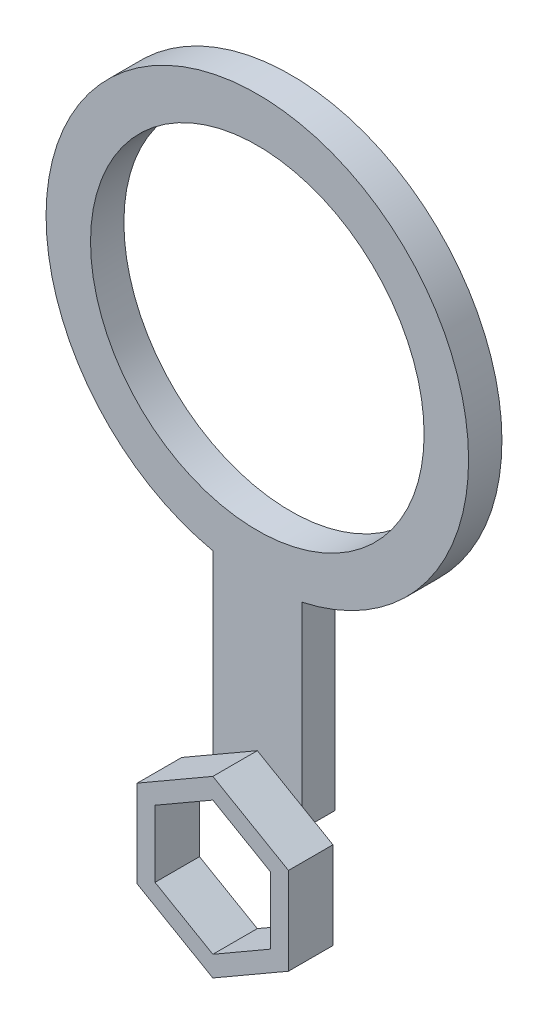
ISO-10303-21;
HEADER;
FILE_DESCRIPTION(('STEP AP214'),'2;1');
FILE_NAME('part.step','',(''),(''),'','','');
FILE_SCHEMA(('AUTOMOTIVE_DESIGN { 1 0 10303 214 1 1 1 1 }'));
ENDSEC;
DATA;
#1=APPLICATION_CONTEXT('core data for automotive mechanical design processes');
#2=APPLICATION_PROTOCOL_DEFINITION('international standard','automotive_design',2000,#1);
#3=PRODUCT_CONTEXT('',#1,'mechanical');
#4=PRODUCT('Part','Part','',(#3));
#5=PRODUCT_RELATED_PRODUCT_CATEGORY('part','',(#4));
#6=PRODUCT_DEFINITION_FORMATION('','',#4);
#7=PRODUCT_DEFINITION_CONTEXT('part definition',#1,'design');
#8=PRODUCT_DEFINITION('design','',#6,#7);
#9=PRODUCT_DEFINITION_SHAPE('','',#8);
#10=(LENGTH_UNIT() NAMED_UNIT(*) SI_UNIT(.MILLI.,.METRE.));
#11=(NAMED_UNIT(*) PLANE_ANGLE_UNIT() SI_UNIT($,.RADIAN.));
#12=(NAMED_UNIT(*) SI_UNIT($,.STERADIAN.) SOLID_ANGLE_UNIT());
#13=UNCERTAINTY_MEASURE_WITH_UNIT(LENGTH_MEASURE(1.E-05),#10,'distance_accuracy_value','');
#14=(GEOMETRIC_REPRESENTATION_CONTEXT(3) GLOBAL_UNCERTAINTY_ASSIGNED_CONTEXT((#13)) GLOBAL_UNIT_ASSIGNED_CONTEXT((#10,
#11,#12)) REPRESENTATION_CONTEXT('',''));
#15=CARTESIAN_POINT('',(0.,0.,0.));
#16=DIRECTION('',(0.,0.,1.));
#17=DIRECTION('',(1.,0.,0.));
#18=AXIS2_PLACEMENT_3D('',#15,#16,#17);
#19=CARTESIAN_POINT('',(4.,0.,3.));
#20=DIRECTION('',(-1.,0.,0.));
#21=DIRECTION('',(0.,-1.,0.));
#22=AXIS2_PLACEMENT_3D('',#19,#20,#21);
#23=PLANE('',#22);
#24=DIRECTION('',(0.,1.,0.));
#25=VECTOR('',#24,1.);
#26=CARTESIAN_POINT('',(4.,0.,3.));
#27=LINE('',#26,#25);
#28=CARTESIAN_POINT('',(4.,3.69504172281361,3.));
#29=VERTEX_POINT('',#28);
#30=CARTESIAN_POINT('',(4.,5.54256258422041,3.));
#31=VERTEX_POINT('',#30);
#32=EDGE_CURVE('E81',#29,#31,#27,.T.);
#33=ORIENTED_EDGE('',*,*,#32,.F.);
#34=DIRECTION('',(0.,0.,1.));
#35=VECTOR('',#34,1.);
#36=CARTESIAN_POINT('',(4.,3.69504172281361,0.));
#37=LINE('',#36,#35);
#38=CARTESIAN_POINT('',(4.,3.69504172281361,0.));
#39=VERTEX_POINT('',#38);
#40=EDGE_CURVE('E173',#39,#29,#37,.T.);
#41=ORIENTED_EDGE('',*,*,#40,.F.);
#42=DIRECTION('',(0.,1.,0.));
#43=VECTOR('',#42,1.);
#44=CARTESIAN_POINT('',(4.,0.,0.));
#45=LINE('',#44,#43);
#46=CARTESIAN_POINT('',(4.,21.4258243789933,0.));
#47=VERTEX_POINT('',#46);
#48=EDGE_CURVE('E72',#39,#47,#45,.T.);
#49=ORIENTED_EDGE('',*,*,#48,.T.);
#50=DIRECTION('',(0.,0.,-1.));
#51=VECTOR('',#50,1.);
#52=CARTESIAN_POINT('',(4.,21.4258243789933,3.));
#53=LINE('',#52,#51);
#54=CARTESIAN_POINT('',(4.,21.4258243789933,3.));
#55=VERTEX_POINT('',#54);
#56=EDGE_CURVE('E44',#55,#47,#53,.T.);
#57=ORIENTED_EDGE('',*,*,#56,.F.);
#58=EDGE_CURVE('E210',#31,#55,#27,.T.);
#59=ORIENTED_EDGE('',*,*,#58,.F.);
#60=EDGE_LOOP('',(#33,#41,#49,#57,#59));
#61=FACE_BOUND('',#60,.T.);
#62=ADVANCED_FACE('F41',(#61),#23,.F.);
#63=CARTESIAN_POINT('',(0.,40.,3.));
#64=DIRECTION('',(0.,0.,-1.));
#65=DIRECTION('',(-1.,0.,0.));
#66=AXIS2_PLACEMENT_3D('',#63,#64,#65);
#67=CYLINDRICAL_SURFACE('',#66,19.);
#68=CARTESIAN_POINT('',(0.,40.,0.));
#69=DIRECTION('',(0.,0.,1.));
#70=DIRECTION('',(1.,0.,0.));
#71=AXIS2_PLACEMENT_3D('',#68,#69,#70);
#72=CIRCLE('',#71,19.);
#73=CARTESIAN_POINT('',(-4.,21.4258243789933,0.));
#74=VERTEX_POINT('',#73);
#75=EDGE_CURVE('E190',#47,#74,#72,.T.);
#76=ORIENTED_EDGE('',*,*,#75,.T.);
#77=DIRECTION('',(0.,0.,-1.));
#78=VECTOR('',#77,1.);
#79=CARTESIAN_POINT('',(-4.,21.4258243789933,3.));
#80=LINE('',#79,#78);
#81=CARTESIAN_POINT('',(-4.,21.4258243789933,3.));
#82=VERTEX_POINT('',#81);
#83=EDGE_CURVE('E211',#82,#74,#80,.T.);
#84=ORIENTED_EDGE('',*,*,#83,.F.);
#85=CARTESIAN_POINT('',(0.,40.,3.));
#86=DIRECTION('',(0.,0.,1.));
#87=DIRECTION('',(1.,0.,0.));
#88=AXIS2_PLACEMENT_3D('',#85,#86,#87);
#89=CIRCLE('',#88,19.);
#90=EDGE_CURVE('E224',#55,#82,#89,.T.);
#91=ORIENTED_EDGE('',*,*,#90,.F.);
#92=ORIENTED_EDGE('',*,*,#56,.T.);
#93=EDGE_LOOP('',(#76,#84,#91,#92));
#94=FACE_BOUND('',#93,.T.);
#95=ADVANCED_FACE('F372',(#94),#67,.T.);
#96=CARTESIAN_POINT('',(-4.,0.,3.));
#97=DIRECTION('',(-1.,0.,0.));
#98=DIRECTION('',(0.,0.,1.));
#99=AXIS2_PLACEMENT_3D('',#96,#97,#98);
#100=PLANE('',#99);
#101=DIRECTION('',(0.,0.,1.));
#102=VECTOR('',#101,1.);
#103=CARTESIAN_POINT('',(-4.,3.69504172281361,0.));
#104=LINE('',#103,#102);
#105=CARTESIAN_POINT('',(-4.,3.69504172281361,0.));
#106=VERTEX_POINT('',#105);
#107=CARTESIAN_POINT('',(-4.,3.69504172281361,3.));
#108=VERTEX_POINT('',#107);
#109=EDGE_CURVE('E184',#106,#108,#104,.T.);
#110=ORIENTED_EDGE('',*,*,#109,.T.);
#111=DIRECTION('',(0.,1.,0.));
#112=VECTOR('',#111,1.);
#113=CARTESIAN_POINT('',(-4.,0.,3.));
#114=LINE('',#113,#112);
#115=CARTESIAN_POINT('',(-4.,5.54256258422041,3.));
#116=VERTEX_POINT('',#115);
#117=EDGE_CURVE('E218',#108,#116,#114,.T.);
#118=ORIENTED_EDGE('',*,*,#117,.T.);
#119=EDGE_CURVE('E60',#116,#82,#114,.T.);
#120=ORIENTED_EDGE('',*,*,#119,.T.);
#121=ORIENTED_EDGE('',*,*,#83,.T.);
#122=DIRECTION('',(0.,1.,0.));
#123=VECTOR('',#122,1.);
#124=CARTESIAN_POINT('',(-4.,0.,0.));
#125=LINE('',#124,#123);
#126=EDGE_CURVE('E196',#106,#74,#125,.T.);
#127=ORIENTED_EDGE('',*,*,#126,.F.);
#128=EDGE_LOOP('',(#110,#118,#120,#121,#127));
#129=FACE_BOUND('',#128,.T.);
#130=ADVANCED_FACE('F352',(#129),#100,.T.);
#131=CARTESIAN_POINT('',(0.,40.,3.));
#132=DIRECTION('',(0.,0.,-1.));
#133=DIRECTION('',(-1.,0.,0.));
#134=AXIS2_PLACEMENT_3D('',#131,#132,#133);
#135=CYLINDRICAL_SURFACE('',#134,15.);
#136=CARTESIAN_POINT('',(0.,40.,3.));
#137=DIRECTION('',(0.,0.,1.));
#138=DIRECTION('',(1.,0.,0.));
#139=AXIS2_PLACEMENT_3D('',#136,#137,#138);
#140=CIRCLE('',#139,15.);
#141=CARTESIAN_POINT('',(15.,40.,3.));
#142=VERTEX_POINT('',#141);
#143=EDGE_CURVE('E202',#142,#142,#140,.T.);
#144=ORIENTED_EDGE('',*,*,#143,.T.);
#145=EDGE_LOOP('',(#144));
#146=FACE_BOUND('',#145,.T.);
#147=CARTESIAN_POINT('',(0.,40.,0.));
#148=DIRECTION('',(0.,0.,1.));
#149=DIRECTION('',(1.,0.,0.));
#150=AXIS2_PLACEMENT_3D('',#147,#148,#149);
#151=CIRCLE('',#150,15.);
#152=CARTESIAN_POINT('',(15.,40.,0.));
#153=VERTEX_POINT('',#152);
#154=EDGE_CURVE('E207',#153,#153,#151,.T.);
#155=ORIENTED_EDGE('',*,*,#154,.F.);
#156=EDGE_LOOP('',(#155));
#157=FACE_BOUND('',#156,.T.);
#158=ADVANCED_FACE('F379',(#146,#157),#135,.F.);
#159=CARTESIAN_POINT('',(0.,0.,3.));
#160=DIRECTION('',(0.,0.,1.));
#161=DIRECTION('',(1.,0.,0.));
#162=AXIS2_PLACEMENT_3D('',#159,#160,#161);
#163=PLANE('',#162);
#164=DIRECTION('',(-0.866025403784438,-0.500000000000001,0.));
#165=VECTOR('',#164,1.);
#166=CARTESIAN_POINT('',(0.,7.85196366097892,3.));
#167=LINE('',#166,#165);
#168=CARTESIAN_POINT('',(0.,7.85196366097892,3.));
#169=VERTEX_POINT('',#168);
#170=EDGE_CURVE('E254',#169,#116,#167,.T.);
#171=ORIENTED_EDGE('',*,*,#170,.F.);
#172=DIRECTION('',(-0.866025403784439,0.5,0.));
#173=VECTOR('',#172,1.);
#174=CARTESIAN_POINT('',(6.80000000000001,3.92598183048946,3.));
#175=LINE('',#174,#173);
#176=EDGE_CURVE('E11',#31,#169,#175,.T.);
#177=ORIENTED_EDGE('',*,*,#176,.F.);
#178=ORIENTED_EDGE('',*,*,#58,.T.);
#179=ORIENTED_EDGE('',*,*,#90,.T.);
#180=ORIENTED_EDGE('',*,*,#119,.F.);
#181=EDGE_LOOP('',(#171,#177,#178,#179,#180));
#182=FACE_BOUND('',#181,.T.);
#183=ORIENTED_EDGE('',*,*,#143,.F.);
#184=EDGE_LOOP('',(#183));
#185=FACE_BOUND('',#184,.T.);
#186=ADVANCED_FACE('F368',(#182,#185),#163,.T.);
#187=CARTESIAN_POINT('',(0.,0.,0.));
#188=DIRECTION('',(0.,0.,1.));
#189=DIRECTION('',(1.,0.,0.));
#190=AXIS2_PLACEMENT_3D('',#187,#188,#189);
#191=PLANE('',#190);
#192=DIRECTION('',(-0.866025403784439,0.5,0.));
#193=VECTOR('',#192,1.);
#194=CARTESIAN_POINT('',(4.,3.69504172281361,0.));
#195=LINE('',#194,#193);
#196=CARTESIAN_POINT('',(0.,6.00444279957211,0.));
#197=VERTEX_POINT('',#196);
#198=EDGE_CURVE('E170',#39,#197,#195,.T.);
#199=ORIENTED_EDGE('',*,*,#198,.T.);
#200=DIRECTION('',(-0.866025403784438,-0.5,0.));
#201=VECTOR('',#200,1.);
#202=CARTESIAN_POINT('',(0.,6.00444279957211,0.));
#203=LINE('',#202,#201);
#204=EDGE_CURVE('E180',#197,#106,#203,.T.);
#205=ORIENTED_EDGE('',*,*,#204,.T.);
#206=ORIENTED_EDGE('',*,*,#126,.T.);
#207=ORIENTED_EDGE('',*,*,#75,.F.);
#208=ORIENTED_EDGE('',*,*,#48,.F.);
#209=EDGE_LOOP('',(#199,#205,#206,#207,#208));
#210=FACE_BOUND('',#209,.T.);
#211=ORIENTED_EDGE('',*,*,#154,.T.);
#212=EDGE_LOOP('',(#211));
#213=FACE_BOUND('',#212,.T.);
#214=ADVANCED_FACE('F187',(#210,#213),#191,.F.);
#215=CARTESIAN_POINT('',(0.,0.,3.));
#216=DIRECTION('',(0.,0.,1.));
#217=DIRECTION('',(1.,0.,0.));
#218=AXIS2_PLACEMENT_3D('',#215,#216,#217);
#219=PLANE('',#218);
#220=DIRECTION('',(-0.866025403784439,0.5,0.));
#221=VECTOR('',#220,1.);
#222=CARTESIAN_POINT('',(5.2,3.00222139978606,3.));
#223=LINE('',#222,#221);
#224=CARTESIAN_POINT('',(5.2,3.00222139978606,3.));
#225=VERTEX_POINT('',#224);
#226=EDGE_CURVE('E316',#225,#29,#223,.T.);
#227=ORIENTED_EDGE('',*,*,#226,.T.);
#228=ORIENTED_EDGE('',*,*,#32,.T.);
#229=CARTESIAN_POINT('',(6.80000000000001,3.92598183048946,3.));
#230=VERTEX_POINT('',#229);
#231=EDGE_CURVE('E52',#230,#31,#175,.T.);
#232=ORIENTED_EDGE('',*,*,#231,.F.);
#233=DIRECTION('',(0.,1.,0.));
#234=VECTOR('',#233,1.);
#235=CARTESIAN_POINT('',(6.8,-3.92598183048946,3.));
#236=LINE('',#235,#234);
#237=CARTESIAN_POINT('',(6.8,-3.92598183048946,3.));
#238=VERTEX_POINT('',#237);
#239=EDGE_CURVE('E260',#238,#230,#236,.T.);
#240=ORIENTED_EDGE('',*,*,#239,.F.);
#241=DIRECTION('',(0.866025403784438,0.5,0.));
#242=VECTOR('',#241,1.);
#243=CARTESIAN_POINT('',(0.,-7.85196366097892,3.));
#244=LINE('',#243,#242);
#245=CARTESIAN_POINT('',(0.,-7.85196366097892,3.));
#246=VERTEX_POINT('',#245);
#247=EDGE_CURVE('E263',#246,#238,#244,.T.);
#248=ORIENTED_EDGE('',*,*,#247,.F.);
#249=DIRECTION('',(0.866025403784439,-0.5,0.));
#250=VECTOR('',#249,1.);
#251=CARTESIAN_POINT('',(-6.80000000000001,-3.92598183048946,3.));
#252=LINE('',#251,#250);
#253=CARTESIAN_POINT('',(-6.80000000000001,-3.92598183048946,3.));
#254=VERTEX_POINT('',#253);
#255=EDGE_CURVE('E266',#254,#246,#252,.T.);
#256=ORIENTED_EDGE('',*,*,#255,.F.);
#257=DIRECTION('',(0.,-1.,0.));
#258=VECTOR('',#257,1.);
#259=CARTESIAN_POINT('',(-6.80000000000001,3.92598183048946,3.));
#260=LINE('',#259,#258);
#261=CARTESIAN_POINT('',(-6.80000000000001,3.92598183048946,3.));
#262=VERTEX_POINT('',#261);
#263=EDGE_CURVE('E250',#262,#254,#260,.T.);
#264=ORIENTED_EDGE('',*,*,#263,.F.);
#265=EDGE_CURVE('E257',#116,#262,#167,.T.);
#266=ORIENTED_EDGE('',*,*,#265,.F.);
#267=ORIENTED_EDGE('',*,*,#117,.F.);
#268=DIRECTION('',(-0.866025403784439,-0.5,0.));
#269=VECTOR('',#268,1.);
#270=CARTESIAN_POINT('',(0.,6.00444279957211,3.));
#271=LINE('',#270,#269);
#272=CARTESIAN_POINT('',(-5.2,3.00222139978606,3.));
#273=VERTEX_POINT('',#272);
#274=EDGE_CURVE('E313',#108,#273,#271,.T.);
#275=ORIENTED_EDGE('',*,*,#274,.T.);
#276=DIRECTION('',(0.,-1.,0.));
#277=VECTOR('',#276,1.);
#278=CARTESIAN_POINT('',(-5.2,3.00222139978606,3.));
#279=LINE('',#278,#277);
#280=CARTESIAN_POINT('',(-5.2,-3.00222139978606,3.));
#281=VERTEX_POINT('',#280);
#282=EDGE_CURVE('E308',#273,#281,#279,.T.);
#283=ORIENTED_EDGE('',*,*,#282,.T.);
#284=DIRECTION('',(0.866025403784439,-0.5,0.));
#285=VECTOR('',#284,1.);
#286=CARTESIAN_POINT('',(-5.2,-3.00222139978606,3.));
#287=LINE('',#286,#285);
#288=CARTESIAN_POINT('',(0.,-6.00444279957211,3.));
#289=VERTEX_POINT('',#288);
#290=EDGE_CURVE('E327',#281,#289,#287,.T.);
#291=ORIENTED_EDGE('',*,*,#290,.T.);
#292=DIRECTION('',(0.866025403784438,0.5,0.));
#293=VECTOR('',#292,1.);
#294=CARTESIAN_POINT('',(0.,-6.00444279957211,3.));
#295=LINE('',#294,#293);
#296=CARTESIAN_POINT('',(5.2,-3.00222139978606,3.));
#297=VERTEX_POINT('',#296);
#298=EDGE_CURVE('E323',#289,#297,#295,.T.);
#299=ORIENTED_EDGE('',*,*,#298,.T.);
#300=DIRECTION('',(0.,1.,0.));
#301=VECTOR('',#300,1.);
#302=CARTESIAN_POINT('',(5.2,-3.00222139978606,3.));
#303=LINE('',#302,#301);
#304=EDGE_CURVE('E319',#297,#225,#303,.T.);
#305=ORIENTED_EDGE('',*,*,#304,.T.);
#306=EDGE_LOOP('',(#227,#228,#232,#240,#248,#256,#264,#266,#267,#275,#283,#291,#299,#305));
#307=FACE_BOUND('',#306,.T.);
#308=ADVANCED_FACE('F356',(#307),#219,.F.);
#309=CARTESIAN_POINT('',(0.,0.,7.));
#310=DIRECTION('',(0.,0.,1.));
#311=DIRECTION('',(1.,0.,0.));
#312=AXIS2_PLACEMENT_3D('',#309,#310,#311);
#313=PLANE('',#312);
#314=DIRECTION('',(0.866025403784439,-0.5,0.));
#315=VECTOR('',#314,1.);
#316=CARTESIAN_POINT('',(-6.80000000000001,-3.92598183048946,7.));
#317=LINE('',#316,#315);
#318=CARTESIAN_POINT('',(-6.80000000000001,-3.92598183048946,7.));
#319=VERTEX_POINT('',#318);
#320=CARTESIAN_POINT('',(0.,-7.85196366097892,7.));
#321=VERTEX_POINT('',#320);
#322=EDGE_CURVE('E253',#319,#321,#317,.T.);
#323=ORIENTED_EDGE('',*,*,#322,.T.);
#324=DIRECTION('',(0.866025403784438,0.5,0.));
#325=VECTOR('',#324,1.);
#326=CARTESIAN_POINT('',(0.,-7.85196366097892,7.));
#327=LINE('',#326,#325);
#328=CARTESIAN_POINT('',(6.8,-3.92598183048946,7.));
#329=VERTEX_POINT('',#328);
#330=EDGE_CURVE('E282',#321,#329,#327,.T.);
#331=ORIENTED_EDGE('',*,*,#330,.T.);
#332=DIRECTION('',(0.,1.,0.));
#333=VECTOR('',#332,1.);
#334=CARTESIAN_POINT('',(6.8,-3.92598183048946,7.));
#335=LINE('',#334,#333);
#336=CARTESIAN_POINT('',(6.80000000000001,3.92598183048946,7.));
#337=VERTEX_POINT('',#336);
#338=EDGE_CURVE('E279',#329,#337,#335,.T.);
#339=ORIENTED_EDGE('',*,*,#338,.T.);
#340=DIRECTION('',(-0.866025403784439,0.5,0.));
#341=VECTOR('',#340,1.);
#342=CARTESIAN_POINT('',(6.80000000000001,3.92598183048946,7.));
#343=LINE('',#342,#341);
#344=CARTESIAN_POINT('',(0.,7.85196366097892,7.));
#345=VERTEX_POINT('',#344);
#346=EDGE_CURVE('E276',#337,#345,#343,.T.);
#347=ORIENTED_EDGE('',*,*,#346,.T.);
#348=DIRECTION('',(-0.866025403784438,-0.500000000000001,0.));
#349=VECTOR('',#348,1.);
#350=CARTESIAN_POINT('',(0.,7.85196366097892,7.));
#351=LINE('',#350,#349);
#352=CARTESIAN_POINT('',(-6.80000000000001,3.92598183048946,7.));
#353=VERTEX_POINT('',#352);
#354=EDGE_CURVE('E273',#345,#353,#351,.T.);
#355=ORIENTED_EDGE('',*,*,#354,.T.);
#356=DIRECTION('',(0.,-1.,0.));
#357=VECTOR('',#356,1.);
#358=CARTESIAN_POINT('',(-6.80000000000001,3.92598183048946,7.));
#359=LINE('',#358,#357);
#360=EDGE_CURVE('E249',#353,#319,#359,.T.);
#361=ORIENTED_EDGE('',*,*,#360,.T.);
#362=EDGE_LOOP('',(#323,#331,#339,#347,#355,#361));
#363=FACE_BOUND('',#362,.T.);
#364=DIRECTION('',(0.866025403784438,0.5,0.));
#365=VECTOR('',#364,1.);
#366=CARTESIAN_POINT('',(0.,-6.00444279957211,7.));
#367=LINE('',#366,#365);
#368=CARTESIAN_POINT('',(0.,-6.00444279957211,7.));
#369=VERTEX_POINT('',#368);
#370=CARTESIAN_POINT('',(5.2,-3.00222139978606,7.));
#371=VERTEX_POINT('',#370);
#372=EDGE_CURVE('E343',#369,#371,#367,.T.);
#373=ORIENTED_EDGE('',*,*,#372,.F.);
#374=DIRECTION('',(0.866025403784439,-0.5,0.));
#375=VECTOR('',#374,1.);
#376=CARTESIAN_POINT('',(-5.2,-3.00222139978606,7.));
#377=LINE('',#376,#375);
#378=CARTESIAN_POINT('',(-5.2,-3.00222139978606,7.));
#379=VERTEX_POINT('',#378);
#380=EDGE_CURVE('E312',#379,#369,#377,.T.);
#381=ORIENTED_EDGE('',*,*,#380,.F.);
#382=DIRECTION('',(0.,-1.,0.));
#383=VECTOR('',#382,1.);
#384=CARTESIAN_POINT('',(-5.2,3.00222139978606,7.));
#385=LINE('',#384,#383);
#386=CARTESIAN_POINT('',(-5.2,3.00222139978606,7.));
#387=VERTEX_POINT('',#386);
#388=EDGE_CURVE('E307',#387,#379,#385,.T.);
#389=ORIENTED_EDGE('',*,*,#388,.F.);
#390=DIRECTION('',(-0.866025403784439,-0.5,0.));
#391=VECTOR('',#390,1.);
#392=CARTESIAN_POINT('',(0.,6.00444279957211,7.));
#393=LINE('',#392,#391);
#394=CARTESIAN_POINT('',(0.,6.00444279957211,7.));
#395=VERTEX_POINT('',#394);
#396=EDGE_CURVE('E333',#395,#387,#393,.T.);
#397=ORIENTED_EDGE('',*,*,#396,.F.);
#398=DIRECTION('',(-0.866025403784439,0.5,0.));
#399=VECTOR('',#398,1.);
#400=CARTESIAN_POINT('',(5.2,3.00222139978606,7.));
#401=LINE('',#400,#399);
#402=CARTESIAN_POINT('',(5.2,3.00222139978606,7.));
#403=VERTEX_POINT('',#402);
#404=EDGE_CURVE('E337',#403,#395,#401,.T.);
#405=ORIENTED_EDGE('',*,*,#404,.F.);
#406=DIRECTION('',(0.,1.,0.));
#407=VECTOR('',#406,1.);
#408=CARTESIAN_POINT('',(5.2,-3.00222139978606,7.));
#409=LINE('',#408,#407);
#410=EDGE_CURVE('E340',#371,#403,#409,.T.);
#411=ORIENTED_EDGE('',*,*,#410,.F.);
#412=EDGE_LOOP('',(#373,#381,#389,#397,#405,#411));
#413=FACE_BOUND('',#412,.T.);
#414=ADVANCED_FACE('F393',(#363,#413),#313,.T.);
#415=CARTESIAN_POINT('',(-6.80000000000001,-3.92598183048946,7.));
#416=DIRECTION('',(0.5,0.866025403784439,0.));
#417=DIRECTION('',(-0.866025403784439,0.5,0.));
#418=AXIS2_PLACEMENT_3D('',#415,#416,#417);
#419=PLANE('',#418);
#420=ORIENTED_EDGE('',*,*,#255,.T.);
#421=DIRECTION('',(0.,0.,-1.));
#422=VECTOR('',#421,1.);
#423=CARTESIAN_POINT('',(0.,-7.85196366097892,7.));
#424=LINE('',#423,#422);
#425=EDGE_CURVE('E192',#321,#246,#424,.T.);
#426=ORIENTED_EDGE('',*,*,#425,.F.);
#427=ORIENTED_EDGE('',*,*,#322,.F.);
#428=DIRECTION('',(0.,0.,-1.));
#429=VECTOR('',#428,1.);
#430=CARTESIAN_POINT('',(-6.80000000000001,-3.92598183048946,7.));
#431=LINE('',#430,#429);
#432=EDGE_CURVE('E245',#319,#254,#431,.T.);
#433=ORIENTED_EDGE('',*,*,#432,.T.);
#434=EDGE_LOOP('',(#420,#426,#427,#433));
#435=FACE_BOUND('',#434,.T.);
#436=ADVANCED_FACE('F389',(#435),#419,.F.);
#437=CARTESIAN_POINT('',(0.,-7.85196366097892,7.));
#438=DIRECTION('',(-0.5,0.866025403784438,0.));
#439=DIRECTION('',(-0.866025403784438,-0.5,0.));
#440=AXIS2_PLACEMENT_3D('',#437,#438,#439);
#441=PLANE('',#440);
#442=ORIENTED_EDGE('',*,*,#247,.T.);
#443=DIRECTION('',(0.,0.,-1.));
#444=VECTOR('',#443,1.);
#445=CARTESIAN_POINT('',(6.8,-3.92598183048946,7.));
#446=LINE('',#445,#444);
#447=EDGE_CURVE('E199',#329,#238,#446,.T.);
#448=ORIENTED_EDGE('',*,*,#447,.F.);
#449=ORIENTED_EDGE('',*,*,#330,.F.);
#450=ORIENTED_EDGE('',*,*,#425,.T.);
#451=EDGE_LOOP('',(#442,#448,#449,#450));
#452=FACE_BOUND('',#451,.T.);
#453=ADVANCED_FACE('F392',(#452),#441,.F.);
#454=CARTESIAN_POINT('',(6.8,-3.92598183048946,7.));
#455=DIRECTION('',(-1.,0.,0.));
#456=DIRECTION('',(0.,-1.,0.));
#457=AXIS2_PLACEMENT_3D('',#454,#455,#456);
#458=PLANE('',#457);
#459=ORIENTED_EDGE('',*,*,#239,.T.);
#460=DIRECTION('',(0.,0.,-1.));
#461=VECTOR('',#460,1.);
#462=CARTESIAN_POINT('',(6.80000000000001,3.92598183048946,7.));
#463=LINE('',#462,#461);
#464=EDGE_CURVE('E233',#337,#230,#463,.T.);
#465=ORIENTED_EDGE('',*,*,#464,.F.);
#466=ORIENTED_EDGE('',*,*,#338,.F.);
#467=ORIENTED_EDGE('',*,*,#447,.T.);
#468=EDGE_LOOP('',(#459,#465,#466,#467));
#469=FACE_BOUND('',#468,.T.);
#470=ADVANCED_FACE('F397',(#469),#458,.F.);
#471=CARTESIAN_POINT('',(6.80000000000001,3.92598183048946,7.));
#472=DIRECTION('',(-0.5,-0.866025403784439,0.));
#473=DIRECTION('',(0.866025403784439,-0.5,0.));
#474=AXIS2_PLACEMENT_3D('',#471,#472,#473);
#475=PLANE('',#474);
#476=ORIENTED_EDGE('',*,*,#231,.T.);
#477=ORIENTED_EDGE('',*,*,#176,.T.);
#478=DIRECTION('',(0.,0.,-1.));
#479=VECTOR('',#478,1.);
#480=CARTESIAN_POINT('',(0.,7.85196366097892,7.));
#481=LINE('',#480,#479);
#482=EDGE_CURVE('E237',#345,#169,#481,.T.);
#483=ORIENTED_EDGE('',*,*,#482,.F.);
#484=ORIENTED_EDGE('',*,*,#346,.F.);
#485=ORIENTED_EDGE('',*,*,#464,.T.);
#486=EDGE_LOOP('',(#476,#477,#483,#484,#485));
#487=FACE_BOUND('',#486,.T.);
#488=ADVANCED_FACE('F401',(#487),#475,.F.);
#489=CARTESIAN_POINT('',(0.,7.85196366097892,7.));
#490=DIRECTION('',(0.500000000000001,-0.866025403784438,0.));
#491=DIRECTION('',(0.866025403784438,0.500000000000001,0.));
#492=AXIS2_PLACEMENT_3D('',#489,#490,#491);
#493=PLANE('',#492);
#494=ORIENTED_EDGE('',*,*,#170,.T.);
#495=ORIENTED_EDGE('',*,*,#265,.T.);
#496=DIRECTION('',(0.,0.,-1.));
#497=VECTOR('',#496,1.);
#498=CARTESIAN_POINT('',(-6.80000000000001,3.92598183048946,7.));
#499=LINE('',#498,#497);
#500=EDGE_CURVE('E241',#353,#262,#499,.T.);
#501=ORIENTED_EDGE('',*,*,#500,.F.);
#502=ORIENTED_EDGE('',*,*,#354,.F.);
#503=ORIENTED_EDGE('',*,*,#482,.T.);
#504=EDGE_LOOP('',(#494,#495,#501,#502,#503));
#505=FACE_BOUND('',#504,.T.);
#506=ADVANCED_FACE('F363',(#505),#493,.F.);
#507=CARTESIAN_POINT('',(-6.80000000000001,3.92598183048946,7.));
#508=DIRECTION('',(1.,0.,0.));
#509=DIRECTION('',(0.,1.,0.));
#510=AXIS2_PLACEMENT_3D('',#507,#508,#509);
#511=PLANE('',#510);
#512=ORIENTED_EDGE('',*,*,#263,.T.);
#513=ORIENTED_EDGE('',*,*,#432,.F.);
#514=ORIENTED_EDGE('',*,*,#360,.F.);
#515=ORIENTED_EDGE('',*,*,#500,.T.);
#516=EDGE_LOOP('',(#512,#513,#514,#515));
#517=FACE_BOUND('',#516,.T.);
#518=ADVANCED_FACE('F408',(#517),#511,.F.);
#519=CARTESIAN_POINT('',(-5.2,-3.00222139978606,7.));
#520=DIRECTION('',(0.5,0.866025403784439,0.));
#521=DIRECTION('',(-0.866025403784439,0.5,0.));
#522=AXIS2_PLACEMENT_3D('',#519,#520,#521);
#523=PLANE('',#522);
#524=ORIENTED_EDGE('',*,*,#290,.F.);
#525=DIRECTION('',(0.,0.,-1.));
#526=VECTOR('',#525,1.);
#527=CARTESIAN_POINT('',(-5.2,-3.00222139978606,7.));
#528=LINE('',#527,#526);
#529=EDGE_CURVE('E303',#379,#281,#528,.T.);
#530=ORIENTED_EDGE('',*,*,#529,.F.);
#531=ORIENTED_EDGE('',*,*,#380,.T.);
#532=DIRECTION('',(0.,0.,-1.));
#533=VECTOR('',#532,1.);
#534=CARTESIAN_POINT('',(0.,-6.00444279957211,7.));
#535=LINE('',#534,#533);
#536=EDGE_CURVE('E270',#369,#289,#535,.T.);
#537=ORIENTED_EDGE('',*,*,#536,.T.);
#538=EDGE_LOOP('',(#524,#530,#531,#537));
#539=FACE_BOUND('',#538,.T.);
#540=ADVANCED_FACE('F411',(#539),#523,.T.);
#541=CARTESIAN_POINT('',(0.,-6.00444279957211,7.));
#542=DIRECTION('',(-0.5,0.866025403784438,0.));
#543=DIRECTION('',(-0.866025403784438,-0.5,0.));
#544=AXIS2_PLACEMENT_3D('',#541,#542,#543);
#545=PLANE('',#544);
#546=ORIENTED_EDGE('',*,*,#298,.F.);
#547=ORIENTED_EDGE('',*,*,#536,.F.);
#548=ORIENTED_EDGE('',*,*,#372,.T.);
#549=DIRECTION('',(0.,0.,-1.));
#550=VECTOR('',#549,1.);
#551=CARTESIAN_POINT('',(5.2,-3.00222139978606,7.));
#552=LINE('',#551,#550);
#553=EDGE_CURVE('E291',#371,#297,#552,.T.);
#554=ORIENTED_EDGE('',*,*,#553,.T.);
#555=EDGE_LOOP('',(#546,#547,#548,#554));
#556=FACE_BOUND('',#555,.T.);
#557=ADVANCED_FACE('F420',(#556),#545,.T.);
#558=CARTESIAN_POINT('',(5.2,-3.00222139978606,7.));
#559=DIRECTION('',(-1.,0.,0.));
#560=DIRECTION('',(0.,-1.,0.));
#561=AXIS2_PLACEMENT_3D('',#558,#559,#560);
#562=PLANE('',#561);
#563=ORIENTED_EDGE('',*,*,#304,.F.);
#564=ORIENTED_EDGE('',*,*,#553,.F.);
#565=ORIENTED_EDGE('',*,*,#410,.T.);
#566=DIRECTION('',(0.,0.,-1.));
#567=VECTOR('',#566,1.);
#568=CARTESIAN_POINT('',(5.2,3.00222139978606,7.));
#569=LINE('',#568,#567);
#570=EDGE_CURVE('E294',#403,#225,#569,.T.);
#571=ORIENTED_EDGE('',*,*,#570,.T.);
#572=EDGE_LOOP('',(#563,#564,#565,#571));
#573=FACE_BOUND('',#572,.T.);
#574=ADVANCED_FACE('F424',(#573),#562,.T.);
#575=CARTESIAN_POINT('',(5.2,3.00222139978606,7.));
#576=DIRECTION('',(-0.5,-0.866025403784439,0.));
#577=DIRECTION('',(0.866025403784439,-0.5,0.));
#578=AXIS2_PLACEMENT_3D('',#575,#576,#577);
#579=PLANE('',#578);
#580=ORIENTED_EDGE('',*,*,#226,.F.);
#581=ORIENTED_EDGE('',*,*,#570,.F.);
#582=ORIENTED_EDGE('',*,*,#404,.T.);
#583=DIRECTION('',(0.,0.,-1.));
#584=VECTOR('',#583,1.);
#585=CARTESIAN_POINT('',(0.,6.00444279957211,7.));
#586=LINE('',#585,#584);
#587=EDGE_CURVE('E175',#395,#197,#586,.T.);
#588=ORIENTED_EDGE('',*,*,#587,.T.);
#589=ORIENTED_EDGE('',*,*,#198,.F.);
#590=ORIENTED_EDGE('',*,*,#40,.T.);
#591=EDGE_LOOP('',(#580,#581,#582,#588,#589,#590));
#592=FACE_BOUND('',#591,.T.);
#593=ADVANCED_FACE('F172',(#592),#579,.T.);
#594=CARTESIAN_POINT('',(0.,6.00444279957211,7.));
#595=DIRECTION('',(0.5,-0.866025403784439,0.));
#596=DIRECTION('',(0.866025403784439,0.5,0.));
#597=AXIS2_PLACEMENT_3D('',#594,#595,#596);
#598=PLANE('',#597);
#599=ORIENTED_EDGE('',*,*,#274,.F.);
#600=ORIENTED_EDGE('',*,*,#109,.F.);
#601=ORIENTED_EDGE('',*,*,#204,.F.);
#602=ORIENTED_EDGE('',*,*,#587,.F.);
#603=ORIENTED_EDGE('',*,*,#396,.T.);
#604=DIRECTION('',(0.,0.,-1.));
#605=VECTOR('',#604,1.);
#606=CARTESIAN_POINT('',(-5.2,3.00222139978606,7.));
#607=LINE('',#606,#605);
#608=EDGE_CURVE('E299',#387,#273,#607,.T.);
#609=ORIENTED_EDGE('',*,*,#608,.T.);
#610=EDGE_LOOP('',(#599,#600,#601,#602,#603,#609));
#611=FACE_BOUND('',#610,.T.);
#612=ADVANCED_FACE('F354',(#611),#598,.T.);
#613=CARTESIAN_POINT('',(-5.2,3.00222139978606,7.));
#614=DIRECTION('',(1.,0.,0.));
#615=DIRECTION('',(0.,0.,-1.));
#616=AXIS2_PLACEMENT_3D('',#613,#614,#615);
#617=PLANE('',#616);
#618=ORIENTED_EDGE('',*,*,#282,.F.);
#619=ORIENTED_EDGE('',*,*,#608,.F.);
#620=ORIENTED_EDGE('',*,*,#388,.T.);
#621=ORIENTED_EDGE('',*,*,#529,.T.);
#622=EDGE_LOOP('',(#618,#619,#620,#621));
#623=FACE_BOUND('',#622,.T.);
#624=ADVANCED_FACE('F433',(#623),#617,.T.);
#625=CLOSED_SHELL('',(#62,#95,#130,#158,#186,#214,#308,#414,#436,#453,#470,#488,#506,#518,#540,
#557,#574,#593,#612,#624));
#626=MANIFOLD_SOLID_BREP('B2',#625);
#627=ADVANCED_BREP_SHAPE_REPRESENTATION('',(#18,#626),#14);
#628=SHAPE_DEFINITION_REPRESENTATION(#9,#627);
ENDSEC;
END-ISO-10303-21;
